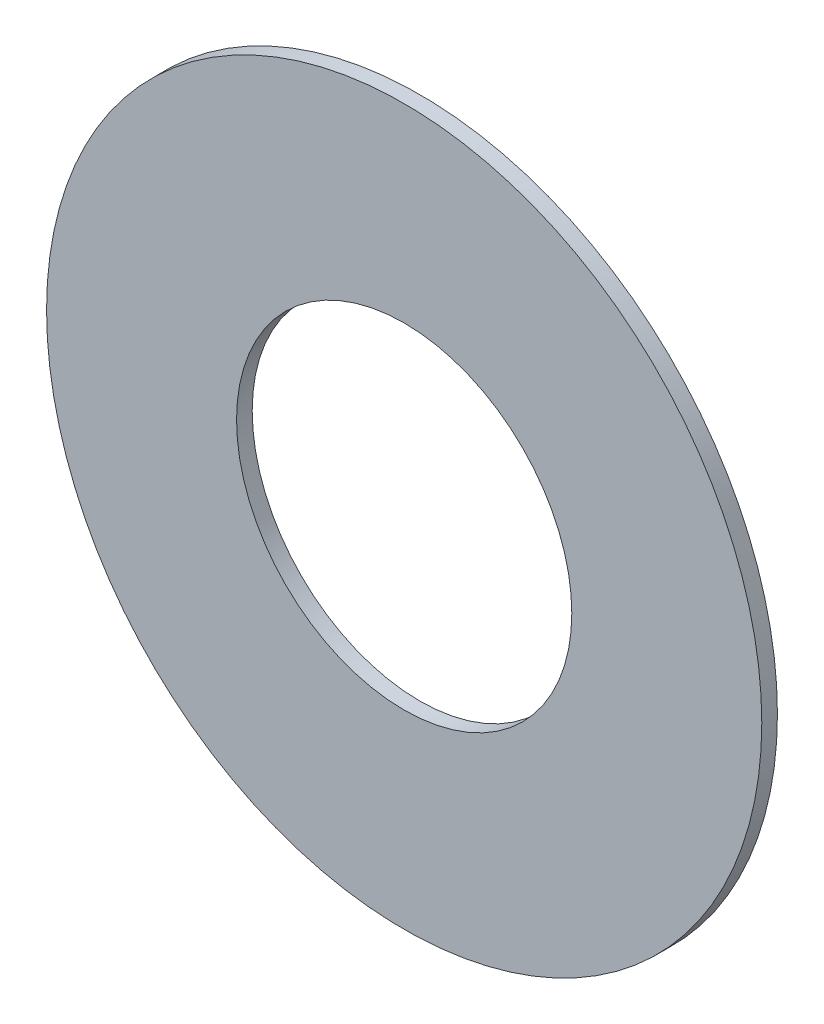
ISO-10303-21;
HEADER;
FILE_DESCRIPTION(('STEP AP214'),'2;1');
FILE_NAME('part.step','',(''),(''),'','','');
FILE_SCHEMA(('AUTOMOTIVE_DESIGN { 1 0 10303 214 1 1 1 1 }'));
ENDSEC;
DATA;
#1=APPLICATION_CONTEXT('core data for automotive mechanical design processes');
#2=APPLICATION_PROTOCOL_DEFINITION('international standard','automotive_design',2000,#1);
#3=PRODUCT_CONTEXT('',#1,'mechanical');
#4=PRODUCT('Part','Part','',(#3));
#5=PRODUCT_RELATED_PRODUCT_CATEGORY('part','',(#4));
#6=PRODUCT_DEFINITION_FORMATION('','',#4);
#7=PRODUCT_DEFINITION_CONTEXT('part definition',#1,'design');
#8=PRODUCT_DEFINITION('design','',#6,#7);
#9=PRODUCT_DEFINITION_SHAPE('','',#8);
#10=(LENGTH_UNIT() NAMED_UNIT(*) SI_UNIT(.MILLI.,.METRE.));
#11=(NAMED_UNIT(*) PLANE_ANGLE_UNIT() SI_UNIT($,.RADIAN.));
#12=(NAMED_UNIT(*) SI_UNIT($,.STERADIAN.) SOLID_ANGLE_UNIT());
#13=UNCERTAINTY_MEASURE_WITH_UNIT(LENGTH_MEASURE(1.E-05),#10,'distance_accuracy_value','');
#14=(GEOMETRIC_REPRESENTATION_CONTEXT(3) GLOBAL_UNCERTAINTY_ASSIGNED_CONTEXT((#13)) GLOBAL_UNIT_ASSIGNED_CONTEXT((#10,
#11,#12)) REPRESENTATION_CONTEXT('',''));
#15=CARTESIAN_POINT('',(0.,0.,0.));
#16=DIRECTION('',(0.,0.,1.));
#17=DIRECTION('',(1.,0.,0.));
#18=AXIS2_PLACEMENT_3D('',#15,#16,#17);
#19=CARTESIAN_POINT('',(166.497,-133.477,-0.045));
#20=DIRECTION('',(0.,0.,-1.));
#21=DIRECTION('',(0.,-1.,0.));
#22=AXIS2_PLACEMENT_3D('',#19,#20,#21);
#23=CYLINDRICAL_SURFACE('',#22,0.375);
#24=CARTESIAN_POINT('',(166.497,-133.477,-0.035));
#25=DIRECTION('',(0.,0.,-1.));
#26=DIRECTION('',(0.,-1.,0.));
#27=AXIS2_PLACEMENT_3D('',#24,#25,#26);
#28=CIRCLE('',#27,0.375);
#29=CARTESIAN_POINT('',(166.497,-133.852,-0.035));
#30=VERTEX_POINT('',#29);
#31=EDGE_CURVE('E21',#30,#30,#28,.T.);
#32=ORIENTED_EDGE('',*,*,#31,.T.);
#33=DIRECTION('',(0.,0.,1.));
#34=VECTOR('',#33,1.);
#35=CARTESIAN_POINT('',(166.497,-133.852,-0.045));
#36=LINE('',#35,#34);
#37=CARTESIAN_POINT('',(166.497,-133.852,0.));
#38=VERTEX_POINT('',#37);
#39=EDGE_CURVE('E11',#30,#38,#36,.T.);
#40=ORIENTED_EDGE('',*,*,#39,.T.);
#41=CARTESIAN_POINT('',(166.497,-133.477,0.));
#42=DIRECTION('',(0.,0.,-1.));
#43=DIRECTION('',(0.,-1.,0.));
#44=AXIS2_PLACEMENT_3D('',#41,#42,#43);
#45=CIRCLE('',#44,0.375);
#46=EDGE_CURVE('E70',#38,#38,#45,.T.);
#47=ORIENTED_EDGE('',*,*,#46,.F.);
#48=ORIENTED_EDGE('',*,*,#39,.F.);
#49=EDGE_LOOP('',(#32,#40,#47,#48));
#50=FACE_BOUND('',#49,.T.);
#51=ADVANCED_FACE('F17',(#50),#23,.F.);
#52=CARTESIAN_POINT('',(166.497,-133.477,-0.035));
#53=DIRECTION('',(0.,0.,1.));
#54=DIRECTION('',(1.,0.,0.));
#55=AXIS2_PLACEMENT_3D('',#52,#53,#54);
#56=PLANE('',#55);
#57=ORIENTED_EDGE('',*,*,#31,.F.);
#58=EDGE_LOOP('',(#57));
#59=FACE_BOUND('',#58,.T.);
#60=CARTESIAN_POINT('',(166.497,-133.477,-0.035));
#61=DIRECTION('',(0.,0.,1.));
#62=DIRECTION('',(1.,0.,0.));
#63=AXIS2_PLACEMENT_3D('',#60,#61,#62);
#64=CIRCLE('',#63,0.8);
#65=CARTESIAN_POINT('',(167.297,-133.477,-0.035));
#66=VERTEX_POINT('',#65);
#67=EDGE_CURVE('E57',#66,#66,#64,.T.);
#68=ORIENTED_EDGE('',*,*,#67,.F.);
#69=EDGE_LOOP('',(#68));
#70=FACE_BOUND('',#69,.T.);
#71=ADVANCED_FACE('F19',(#59,#70),#56,.F.);
#72=CARTESIAN_POINT('',(166.497,-133.477,0.));
#73=DIRECTION('',(0.,0.,1.));
#74=DIRECTION('',(1.,0.,0.));
#75=AXIS2_PLACEMENT_3D('',#72,#73,#74);
#76=PLANE('',#75);
#77=ORIENTED_EDGE('',*,*,#46,.T.);
#78=EDGE_LOOP('',(#77));
#79=FACE_BOUND('',#78,.T.);
#80=CARTESIAN_POINT('',(166.497,-133.477,0.));
#81=DIRECTION('',(0.,0.,1.));
#82=DIRECTION('',(1.,0.,0.));
#83=AXIS2_PLACEMENT_3D('',#80,#81,#82);
#84=CIRCLE('',#83,0.8);
#85=CARTESIAN_POINT('',(167.297,-133.477,0.));
#86=VERTEX_POINT('',#85);
#87=EDGE_CURVE('E55',#86,#86,#84,.T.);
#88=ORIENTED_EDGE('',*,*,#87,.T.);
#89=EDGE_LOOP('',(#88));
#90=FACE_BOUND('',#89,.T.);
#91=ADVANCED_FACE('F61',(#79,#90),#76,.T.);
#92=CARTESIAN_POINT('',(166.497,-133.477,-0.035));
#93=DIRECTION('',(0.,0.,1.));
#94=DIRECTION('',(1.,0.,0.));
#95=AXIS2_PLACEMENT_3D('',#92,#93,#94);
#96=CYLINDRICAL_SURFACE('',#95,0.8);
#97=ORIENTED_EDGE('',*,*,#87,.F.);
#98=DIRECTION('',(0.,0.,1.));
#99=VECTOR('',#98,1.);
#100=CARTESIAN_POINT('',(167.297,-133.477,-0.035));
#101=LINE('',#100,#99);
#102=EDGE_CURVE('E52',#66,#86,#101,.T.);
#103=ORIENTED_EDGE('',*,*,#102,.F.);
#104=ORIENTED_EDGE('',*,*,#67,.T.);
#105=ORIENTED_EDGE('',*,*,#102,.T.);
#106=EDGE_LOOP('',(#97,#103,#104,#105));
#107=FACE_BOUND('',#106,.T.);
#108=ADVANCED_FACE('F54',(#107),#96,.T.);
#109=CLOSED_SHELL('',(#51,#71,#91,#108));
#110=MANIFOLD_SOLID_BREP('B1',#109);
#111=ADVANCED_BREP_SHAPE_REPRESENTATION('',(#18,#110),#14);
#112=SHAPE_DEFINITION_REPRESENTATION(#9,#111);
ENDSEC;
END-ISO-10303-21;
